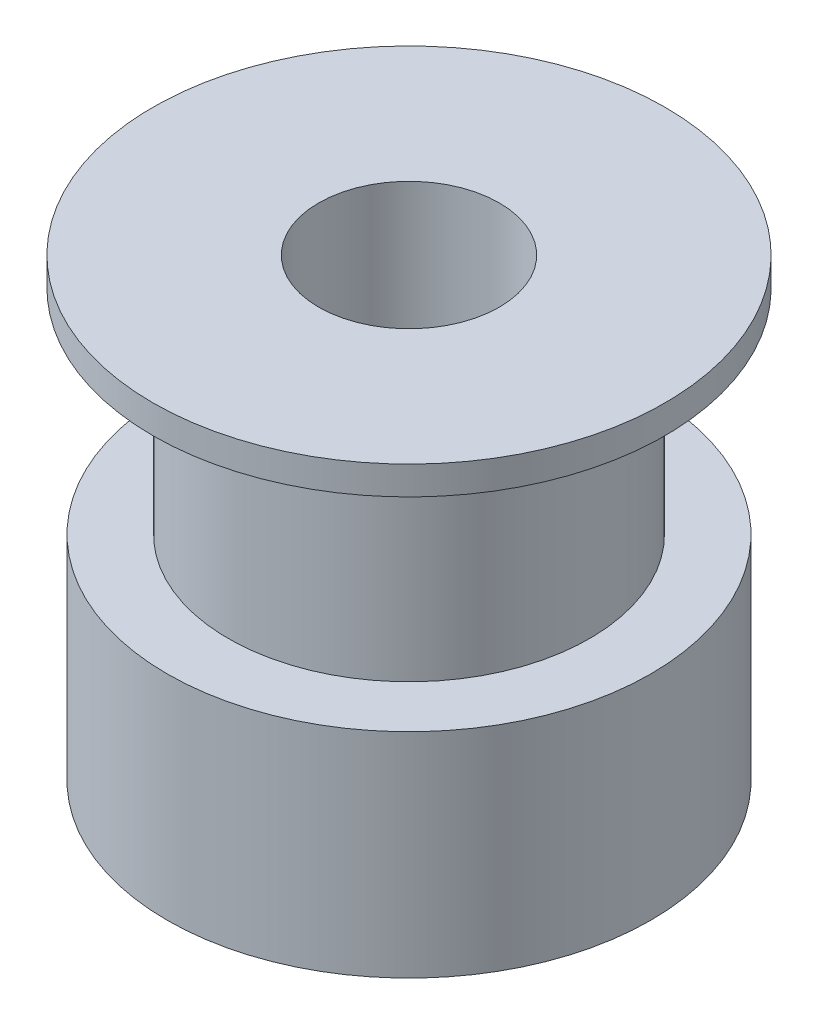
ISO-10303-21;
HEADER;
FILE_DESCRIPTION(('STEP AP214'),'2;1');
FILE_NAME('part.step','',(''),(''),'','','');
FILE_SCHEMA(('AUTOMOTIVE_DESIGN { 1 0 10303 214 1 1 1 1 }'));
ENDSEC;
DATA;
#1=APPLICATION_CONTEXT('core data for automotive mechanical design processes');
#2=APPLICATION_PROTOCOL_DEFINITION('international standard','automotive_design',2000,#1);
#3=PRODUCT_CONTEXT('',#1,'mechanical');
#4=PRODUCT('Part','Part','',(#3));
#5=PRODUCT_RELATED_PRODUCT_CATEGORY('part','',(#4));
#6=PRODUCT_DEFINITION_FORMATION('','',#4);
#7=PRODUCT_DEFINITION_CONTEXT('part definition',#1,'design');
#8=PRODUCT_DEFINITION('design','',#6,#7);
#9=PRODUCT_DEFINITION_SHAPE('','',#8);
#10=(LENGTH_UNIT() NAMED_UNIT(*) SI_UNIT(.MILLI.,.METRE.));
#11=(NAMED_UNIT(*) PLANE_ANGLE_UNIT() SI_UNIT($,.RADIAN.));
#12=(NAMED_UNIT(*) SI_UNIT($,.STERADIAN.) SOLID_ANGLE_UNIT());
#13=UNCERTAINTY_MEASURE_WITH_UNIT(LENGTH_MEASURE(1.E-05),#10,'distance_accuracy_value','');
#14=(GEOMETRIC_REPRESENTATION_CONTEXT(3) GLOBAL_UNCERTAINTY_ASSIGNED_CONTEXT((#13)) GLOBAL_UNIT_ASSIGNED_CONTEXT((#10,
#11,#12)) REPRESENTATION_CONTEXT('',''));
#15=CARTESIAN_POINT('',(0.,0.,0.));
#16=DIRECTION('',(0.,0.,1.));
#17=DIRECTION('',(1.,0.,0.));
#18=AXIS2_PLACEMENT_3D('',#15,#16,#17);
#19=CARTESIAN_POINT('',(0.,-8.,-3.175));
#20=DIRECTION('',(0.,-1.,0.));
#21=DIRECTION('',(0.,0.,-1.));
#22=AXIS2_PLACEMENT_3D('',#19,#20,#21);
#23=PLANE('',#22);
#24=CARTESIAN_POINT('',(0.,-7.99999999999999,0.));
#25=DIRECTION('',(0.,-1.,0.));
#26=DIRECTION('',(0.,0.,-1.));
#27=AXIS2_PLACEMENT_3D('',#24,#25,#26);
#28=CIRCLE('',#27,8.49999999999996);
#29=CARTESIAN_POINT('',(0.,-7.99999999999999,-8.49999999999996));
#30=VERTEX_POINT('',#29);
#31=EDGE_CURVE('E10',#30,#30,#28,.T.);
#32=ORIENTED_EDGE('',*,*,#31,.T.);
#33=EDGE_LOOP('',(#32));
#34=FACE_BOUND('',#33,.T.);
#35=CARTESIAN_POINT('',(0.,-7.99999999999999,0.));
#36=DIRECTION('',(0.,-1.,0.));
#37=DIRECTION('',(0.,0.,-1.));
#38=AXIS2_PLACEMENT_3D('',#35,#36,#37);
#39=CIRCLE('',#38,3.175);
#40=CARTESIAN_POINT('',(0.,-7.99999999999999,-3.175));
#41=VERTEX_POINT('',#40);
#42=EDGE_CURVE('E61',#41,#41,#39,.T.);
#43=ORIENTED_EDGE('',*,*,#42,.F.);
#44=EDGE_LOOP('',(#43));
#45=FACE_BOUND('',#44,.T.);
#46=ADVANCED_FACE('F33',(#34,#45),#23,.T.);
#47=CARTESIAN_POINT('',(0.,-99.3083509803681,0.));
#48=DIRECTION('',(0.,-1.,0.));
#49=DIRECTION('',(0.,0.,-1.));
#50=AXIS2_PLACEMENT_3D('',#47,#48,#49);
#51=CYLINDRICAL_SURFACE('',#50,8.49999999999996);
#52=CARTESIAN_POINT('',(0.,-0.5,0.));
#53=DIRECTION('',(0.,-1.,0.));
#54=DIRECTION('',(0.,0.,-1.));
#55=AXIS2_PLACEMENT_3D('',#52,#53,#54);
#56=CIRCLE('',#55,8.49999999999996);
#57=CARTESIAN_POINT('',(0.,-0.5,-8.49999999999996));
#58=VERTEX_POINT('',#57);
#59=EDGE_CURVE('E39',#58,#58,#56,.T.);
#60=ORIENTED_EDGE('',*,*,#59,.T.);
#61=EDGE_LOOP('',(#60));
#62=FACE_BOUND('',#61,.T.);
#63=ORIENTED_EDGE('',*,*,#31,.F.);
#64=EDGE_LOOP('',(#63));
#65=FACE_BOUND('',#64,.T.);
#66=ADVANCED_FACE('F69',(#62,#65),#51,.T.);
#67=CARTESIAN_POINT('',(0.,-0.500000000000001,-8.49999999999996));
#68=DIRECTION('',(0.,1.,0.));
#69=DIRECTION('',(0.,0.,1.));
#70=AXIS2_PLACEMENT_3D('',#67,#68,#69);
#71=PLANE('',#70);
#72=CARTESIAN_POINT('',(0.,-0.5,0.));
#73=DIRECTION('',(0.,-1.,0.));
#74=DIRECTION('',(0.,0.,-1.));
#75=AXIS2_PLACEMENT_3D('',#72,#73,#74);
#76=CIRCLE('',#75,6.35);
#77=CARTESIAN_POINT('',(0.,-0.5,-6.35));
#78=VERTEX_POINT('',#77);
#79=EDGE_CURVE('E43',#78,#78,#76,.T.);
#80=ORIENTED_EDGE('',*,*,#79,.T.);
#81=EDGE_LOOP('',(#80));
#82=FACE_BOUND('',#81,.T.);
#83=ORIENTED_EDGE('',*,*,#59,.F.);
#84=EDGE_LOOP('',(#83));
#85=FACE_BOUND('',#84,.T.);
#86=ADVANCED_FACE('F73',(#82,#85),#71,.T.);
#87=CARTESIAN_POINT('',(0.,-99.3083509803681,0.));
#88=DIRECTION('',(0.,-1.,0.));
#89=DIRECTION('',(0.,0.,-1.));
#90=AXIS2_PLACEMENT_3D('',#87,#88,#89);
#91=CYLINDRICAL_SURFACE('',#90,6.35);
#92=CARTESIAN_POINT('',(0.,6.99999999999999,0.));
#93=DIRECTION('',(0.,-1.,0.));
#94=DIRECTION('',(0.,0.,-1.));
#95=AXIS2_PLACEMENT_3D('',#92,#93,#94);
#96=CIRCLE('',#95,6.35);
#97=CARTESIAN_POINT('',(0.,6.99999999999999,-6.35));
#98=VERTEX_POINT('',#97);
#99=EDGE_CURVE('E47',#98,#98,#96,.T.);
#100=ORIENTED_EDGE('',*,*,#99,.T.);
#101=EDGE_LOOP('',(#100));
#102=FACE_BOUND('',#101,.T.);
#103=ORIENTED_EDGE('',*,*,#79,.F.);
#104=EDGE_LOOP('',(#103));
#105=FACE_BOUND('',#104,.T.);
#106=ADVANCED_FACE('F77',(#102,#105),#91,.T.);
#107=CARTESIAN_POINT('',(0.,7.,-6.35));
#108=DIRECTION('',(0.,-1.,0.));
#109=DIRECTION('',(0.,0.,-1.));
#110=AXIS2_PLACEMENT_3D('',#107,#108,#109);
#111=PLANE('',#110);
#112=CARTESIAN_POINT('',(0.,6.99999999999999,0.));
#113=DIRECTION('',(0.,-1.,0.));
#114=DIRECTION('',(0.,0.,-1.));
#115=AXIS2_PLACEMENT_3D('',#112,#113,#114);
#116=CIRCLE('',#115,9.);
#117=CARTESIAN_POINT('',(0.,6.99999999999999,-9.));
#118=VERTEX_POINT('',#117);
#119=EDGE_CURVE('E52',#118,#118,#116,.T.);
#120=ORIENTED_EDGE('',*,*,#119,.T.);
#121=EDGE_LOOP('',(#120));
#122=FACE_BOUND('',#121,.T.);
#123=ORIENTED_EDGE('',*,*,#99,.F.);
#124=EDGE_LOOP('',(#123));
#125=FACE_BOUND('',#124,.T.);
#126=ADVANCED_FACE('F84',(#122,#125),#111,.T.);
#127=CARTESIAN_POINT('',(0.,-99.3083509803681,0.));
#128=DIRECTION('',(0.,-1.,0.));
#129=DIRECTION('',(0.,0.,-1.));
#130=AXIS2_PLACEMENT_3D('',#127,#128,#129);
#131=CYLINDRICAL_SURFACE('',#130,9.);
#132=CARTESIAN_POINT('',(0.,7.99999999999999,0.));
#133=DIRECTION('',(0.,-1.,0.));
#134=DIRECTION('',(0.,0.,-1.));
#135=AXIS2_PLACEMENT_3D('',#132,#133,#134);
#136=CIRCLE('',#135,9.);
#137=CARTESIAN_POINT('',(0.,7.99999999999999,-9.));
#138=VERTEX_POINT('',#137);
#139=EDGE_CURVE('E55',#138,#138,#136,.T.);
#140=ORIENTED_EDGE('',*,*,#139,.T.);
#141=EDGE_LOOP('',(#140));
#142=FACE_BOUND('',#141,.T.);
#143=ORIENTED_EDGE('',*,*,#119,.F.);
#144=EDGE_LOOP('',(#143));
#145=FACE_BOUND('',#144,.T.);
#146=ADVANCED_FACE('F88',(#142,#145),#131,.T.);
#147=CARTESIAN_POINT('',(0.,8.,-9.));
#148=DIRECTION('',(0.,1.,0.));
#149=DIRECTION('',(0.,0.,1.));
#150=AXIS2_PLACEMENT_3D('',#147,#148,#149);
#151=PLANE('',#150);
#152=CARTESIAN_POINT('',(0.,7.99999999999999,0.));
#153=DIRECTION('',(0.,-1.,0.));
#154=DIRECTION('',(0.,0.,-1.));
#155=AXIS2_PLACEMENT_3D('',#152,#153,#154);
#156=CIRCLE('',#155,3.175);
#157=CARTESIAN_POINT('',(0.,7.99999999999999,-3.175));
#158=VERTEX_POINT('',#157);
#159=EDGE_CURVE('E58',#158,#158,#156,.T.);
#160=ORIENTED_EDGE('',*,*,#159,.T.);
#161=EDGE_LOOP('',(#160));
#162=FACE_BOUND('',#161,.T.);
#163=ORIENTED_EDGE('',*,*,#139,.F.);
#164=EDGE_LOOP('',(#163));
#165=FACE_BOUND('',#164,.T.);
#166=ADVANCED_FACE('F92',(#162,#165),#151,.T.);
#167=CARTESIAN_POINT('',(0.,-99.3083509803681,0.));
#168=DIRECTION('',(0.,-1.,0.));
#169=DIRECTION('',(0.,0.,-1.));
#170=AXIS2_PLACEMENT_3D('',#167,#168,#169);
#171=CYLINDRICAL_SURFACE('',#170,3.175);
#172=ORIENTED_EDGE('',*,*,#42,.T.);
#173=EDGE_LOOP('',(#172));
#174=FACE_BOUND('',#173,.T.);
#175=ORIENTED_EDGE('',*,*,#159,.F.);
#176=EDGE_LOOP('',(#175));
#177=FACE_BOUND('',#176,.T.);
#178=ADVANCED_FACE('F65',(#174,#177),#171,.F.);
#179=CLOSED_SHELL('',(#46,#66,#86,#106,#126,#146,#166,#178));
#180=MANIFOLD_SOLID_BREP('B2',#179);
#181=ADVANCED_BREP_SHAPE_REPRESENTATION('',(#18,#180),#14);
#182=SHAPE_DEFINITION_REPRESENTATION(#9,#181);
ENDSEC;
END-ISO-10303-21;
